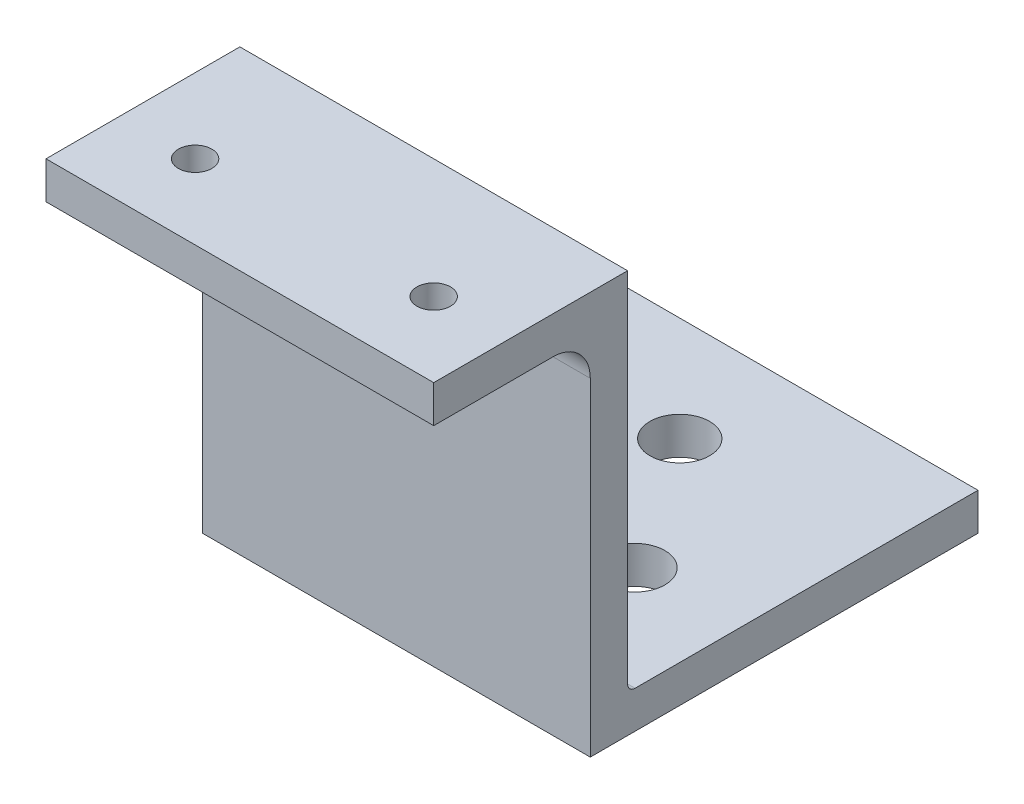
ISO-10303-21;
HEADER;
FILE_DESCRIPTION(('STEP AP214'),'2;1');
FILE_NAME('part.step','',(''),(''),'','','');
FILE_SCHEMA(('AUTOMOTIVE_DESIGN { 1 0 10303 214 1 1 1 1 }'));
ENDSEC;
DATA;
#1=APPLICATION_CONTEXT('core data for automotive mechanical design processes');
#2=APPLICATION_PROTOCOL_DEFINITION('international standard','automotive_design',2000,#1);
#3=PRODUCT_CONTEXT('',#1,'mechanical');
#4=PRODUCT('Part','Part','',(#3));
#5=PRODUCT_RELATED_PRODUCT_CATEGORY('part','',(#4));
#6=PRODUCT_DEFINITION_FORMATION('','',#4);
#7=PRODUCT_DEFINITION_CONTEXT('part definition',#1,'design');
#8=PRODUCT_DEFINITION('design','',#6,#7);
#9=PRODUCT_DEFINITION_SHAPE('','',#8);
#10=(LENGTH_UNIT() NAMED_UNIT(*) SI_UNIT(.MILLI.,.METRE.));
#11=(NAMED_UNIT(*) PLANE_ANGLE_UNIT() SI_UNIT($,.RADIAN.));
#12=(NAMED_UNIT(*) SI_UNIT($,.STERADIAN.) SOLID_ANGLE_UNIT());
#13=UNCERTAINTY_MEASURE_WITH_UNIT(LENGTH_MEASURE(1.E-05),#10,'distance_accuracy_value','');
#14=(GEOMETRIC_REPRESENTATION_CONTEXT(3) GLOBAL_UNCERTAINTY_ASSIGNED_CONTEXT((#13)) GLOBAL_UNIT_ASSIGNED_CONTEXT((#10,
#11,#12)) REPRESENTATION_CONTEXT('',''));
#15=CARTESIAN_POINT('',(0.,0.,0.));
#16=DIRECTION('',(0.,0.,1.));
#17=DIRECTION('',(1.,0.,0.));
#18=AXIS2_PLACEMENT_3D('',#15,#16,#17);
#19=CARTESIAN_POINT('',(-6.00000000000001,5.,-46.));
#20=DIRECTION('',(1.,0.,0.));
#21=DIRECTION('',(0.,0.,-1.));
#22=AXIS2_PLACEMENT_3D('',#19,#20,#21);
#23=PLANE('',#22);
#24=DIRECTION('',(0.,-1.,0.));
#25=VECTOR('',#24,1.);
#26=CARTESIAN_POINT('',(-6.00000000000001,5.,-46.));
#27=LINE('',#26,#25);
#28=CARTESIAN_POINT('',(-6.00000000000001,10.,-46.));
#29=VERTEX_POINT('',#28);
#30=CARTESIAN_POINT('',(-6.00000000000001,5.,-46.));
#31=VERTEX_POINT('',#30);
#32=EDGE_CURVE('E137',#29,#31,#27,.T.);
#33=ORIENTED_EDGE('',*,*,#32,.T.);
#34=DIRECTION('',(0.,0.,-1.));
#35=VECTOR('',#34,1.);
#36=CARTESIAN_POINT('',(-6.00000000000023,5.,6.));
#37=LINE('',#36,#35);
#38=CARTESIAN_POINT('',(-6.00000000000023,5.,6.));
#39=VERTEX_POINT('',#38);
#40=EDGE_CURVE('E52',#39,#31,#37,.T.);
#41=ORIENTED_EDGE('',*,*,#40,.F.);
#42=DIRECTION('',(0.,-1.,0.));
#43=VECTOR('',#42,1.);
#44=CARTESIAN_POINT('',(-6.00000000000023,5.,6.));
#45=LINE('',#44,#43);
#46=CARTESIAN_POINT('',(-6.00000000000023,49.,6.));
#47=VERTEX_POINT('',#46);
#48=EDGE_CURVE('E128',#47,#39,#45,.T.);
#49=ORIENTED_EDGE('',*,*,#48,.F.);
#50=CARTESIAN_POINT('',(-6.00000000000025,49.,11.));
#51=DIRECTION('',(1.,0.,0.));
#52=DIRECTION('',(0.,0.,-1.));
#53=AXIS2_PLACEMENT_3D('',#50,#51,#52);
#54=CIRCLE('',#53,5.);
#55=CARTESIAN_POINT('',(-6.00000000000023,54.,11.));
#56=VERTEX_POINT('',#55);
#57=EDGE_CURVE('E248',#47,#56,#54,.T.);
#58=ORIENTED_EDGE('',*,*,#57,.T.);
#59=DIRECTION('',(0.,0.,1.));
#60=VECTOR('',#59,1.);
#61=CARTESIAN_POINT('',(-6.00000000000023,54.,1.00000000000033));
#62=LINE('',#61,#60);
#63=CARTESIAN_POINT('',(-6.00000000000022,54.,27.0000000000003));
#64=VERTEX_POINT('',#63);
#65=EDGE_CURVE('E158',#56,#64,#62,.T.);
#66=ORIENTED_EDGE('',*,*,#65,.T.);
#67=DIRECTION('',(0.,-1.,0.));
#68=VECTOR('',#67,1.);
#69=CARTESIAN_POINT('',(-6.00000000000022,59.,27.0000000000003));
#70=LINE('',#69,#68);
#71=CARTESIAN_POINT('',(-6.00000000000022,59.,27.0000000000003));
#72=VERTEX_POINT('',#71);
#73=EDGE_CURVE('E171',#72,#64,#70,.T.);
#74=ORIENTED_EDGE('',*,*,#73,.F.);
#75=DIRECTION('',(0.,0.,1.));
#76=VECTOR('',#75,1.);
#77=CARTESIAN_POINT('',(-6.00000000000023,59.,1.00000000000033));
#78=LINE('',#77,#76);
#79=CARTESIAN_POINT('',(-6.00000000000023,59.,1.00000000000033));
#80=VERTEX_POINT('',#79);
#81=EDGE_CURVE('E219',#80,#72,#78,.T.);
#82=ORIENTED_EDGE('',*,*,#81,.F.);
#83=DIRECTION('',(0.,-1.,0.));
#84=VECTOR('',#83,1.);
#85=CARTESIAN_POINT('',(-6.00000000000023,54.,1.00000000000033));
#86=LINE('',#85,#84);
#87=CARTESIAN_POINT('',(-6.00000000000023,11.,1.00000000000033));
#88=VERTEX_POINT('',#87);
#89=EDGE_CURVE('E175',#80,#88,#86,.T.);
#90=ORIENTED_EDGE('',*,*,#89,.T.);
#91=CARTESIAN_POINT('',(-6.0000000000002,11.,3.33934269125535E-13));
#92=DIRECTION('',(1.,0.,0.));
#93=DIRECTION('',(0.,0.,-1.));
#94=AXIS2_PLACEMENT_3D('',#91,#92,#93);
#95=CIRCLE('',#94,1.);
#96=CARTESIAN_POINT('',(-6.0000000000002,10.,3.19189119579733E-13));
#97=VERTEX_POINT('',#96);
#98=EDGE_CURVE('E44',#88,#97,#95,.T.);
#99=ORIENTED_EDGE('',*,*,#98,.T.);
#100=DIRECTION('',(0.,0.,1.));
#101=VECTOR('',#100,1.);
#102=CARTESIAN_POINT('',(-6.00000000000001,10.,-46.));
#103=LINE('',#102,#101);
#104=EDGE_CURVE('E255',#29,#97,#103,.T.);
#105=ORIENTED_EDGE('',*,*,#104,.F.);
#106=EDGE_LOOP('',(#33,#41,#49,#58,#66,#74,#82,#90,#99,#105));
#107=FACE_BOUND('',#106,.T.);
#108=ADVANCED_FACE('F35',(#107),#23,.F.);
#109=CARTESIAN_POINT('',(-6.00000000000023,5.,6.));
#110=DIRECTION('',(0.,0.,-1.));
#111=DIRECTION('',(-1.,0.,0.));
#112=AXIS2_PLACEMENT_3D('',#109,#110,#111);
#113=PLANE('',#112);
#114=ORIENTED_EDGE('',*,*,#48,.T.);
#115=DIRECTION('',(-1.,0.,0.));
#116=VECTOR('',#115,1.);
#117=CARTESIAN_POINT('',(46.,5.,6.));
#118=LINE('',#117,#116);
#119=CARTESIAN_POINT('',(46.,5.,6.));
#120=VERTEX_POINT('',#119);
#121=EDGE_CURVE('E114',#120,#39,#118,.T.);
#122=ORIENTED_EDGE('',*,*,#121,.F.);
#123=DIRECTION('',(0.,-1.,0.));
#124=VECTOR('',#123,1.);
#125=CARTESIAN_POINT('',(46.,5.,6.));
#126=LINE('',#125,#124);
#127=CARTESIAN_POINT('',(46.,49.,6.));
#128=VERTEX_POINT('',#127);
#129=EDGE_CURVE('E125',#128,#120,#126,.T.);
#130=ORIENTED_EDGE('',*,*,#129,.F.);
#131=DIRECTION('',(1.,0.,0.));
#132=VECTOR('',#131,1.);
#133=CARTESIAN_POINT('',(-6.00000000000023,49.,6.));
#134=LINE('',#133,#132);
#135=EDGE_CURVE('E247',#128,#47,#134,.F.);
#136=ORIENTED_EDGE('',*,*,#135,.T.);
#137=EDGE_LOOP('',(#114,#122,#130,#136));
#138=FACE_BOUND('',#137,.T.);
#139=ADVANCED_FACE('F124',(#138),#113,.F.);
#140=CARTESIAN_POINT('',(46.,5.,-46.));
#141=DIRECTION('',(-1.,0.,0.));
#142=DIRECTION('',(0.,0.,1.));
#143=AXIS2_PLACEMENT_3D('',#140,#141,#142);
#144=PLANE('',#143);
#145=ORIENTED_EDGE('',*,*,#129,.T.);
#146=DIRECTION('',(0.,0.,1.));
#147=VECTOR('',#146,1.);
#148=CARTESIAN_POINT('',(46.,5.,-46.));
#149=LINE('',#148,#147);
#150=CARTESIAN_POINT('',(46.,5.,-46.));
#151=VERTEX_POINT('',#150);
#152=EDGE_CURVE('E111',#151,#120,#149,.T.);
#153=ORIENTED_EDGE('',*,*,#152,.F.);
#154=DIRECTION('',(0.,-1.,0.));
#155=VECTOR('',#154,1.);
#156=CARTESIAN_POINT('',(46.,5.,-46.));
#157=LINE('',#156,#155);
#158=CARTESIAN_POINT('',(46.,10.,-46.));
#159=VERTEX_POINT('',#158);
#160=EDGE_CURVE('E133',#159,#151,#157,.T.);
#161=ORIENTED_EDGE('',*,*,#160,.F.);
#162=DIRECTION('',(0.,0.,-1.));
#163=VECTOR('',#162,1.);
#164=CARTESIAN_POINT('',(46.,10.,6.));
#165=LINE('',#164,#163);
#166=CARTESIAN_POINT('',(46.,10.,0.));
#167=VERTEX_POINT('',#166);
#168=EDGE_CURVE('E182',#167,#159,#165,.T.);
#169=ORIENTED_EDGE('',*,*,#168,.F.);
#170=CARTESIAN_POINT('',(46.,11.,0.));
#171=DIRECTION('',(-1.,0.,0.));
#172=DIRECTION('',(0.,0.,1.));
#173=AXIS2_PLACEMENT_3D('',#170,#171,#172);
#174=CIRCLE('',#173,1.);
#175=CARTESIAN_POINT('',(46.,11.,1.));
#176=VERTEX_POINT('',#175);
#177=EDGE_CURVE('E11',#167,#176,#174,.T.);
#178=ORIENTED_EDGE('',*,*,#177,.T.);
#179=DIRECTION('',(0.,-1.,0.));
#180=VECTOR('',#179,1.);
#181=CARTESIAN_POINT('',(46.,54.,1.));
#182=LINE('',#181,#180);
#183=CARTESIAN_POINT('',(46.,59.,1.));
#184=VERTEX_POINT('',#183);
#185=EDGE_CURVE('E185',#184,#176,#182,.T.);
#186=ORIENTED_EDGE('',*,*,#185,.F.);
#187=DIRECTION('',(0.,0.,-1.));
#188=VECTOR('',#187,1.);
#189=CARTESIAN_POINT('',(46.,59.,1.));
#190=LINE('',#189,#188);
#191=CARTESIAN_POINT('',(46.,59.,27.));
#192=VERTEX_POINT('',#191);
#193=EDGE_CURVE('E167',#192,#184,#190,.T.);
#194=ORIENTED_EDGE('',*,*,#193,.F.);
#195=DIRECTION('',(0.,-1.,0.));
#196=VECTOR('',#195,1.);
#197=CARTESIAN_POINT('',(46.,59.,27.));
#198=LINE('',#197,#196);
#199=CARTESIAN_POINT('',(46.,54.,27.));
#200=VERTEX_POINT('',#199);
#201=EDGE_CURVE('E168',#192,#200,#198,.T.);
#202=ORIENTED_EDGE('',*,*,#201,.T.);
#203=DIRECTION('',(0.,0.,-1.));
#204=VECTOR('',#203,1.);
#205=CARTESIAN_POINT('',(46.,54.,1.));
#206=LINE('',#205,#204);
#207=CARTESIAN_POINT('',(46.,54.,11.));
#208=VERTEX_POINT('',#207);
#209=EDGE_CURVE('E153',#200,#208,#206,.T.);
#210=ORIENTED_EDGE('',*,*,#209,.T.);
#211=CARTESIAN_POINT('',(46.,49.,11.));
#212=DIRECTION('',(-1.,0.,0.));
#213=DIRECTION('',(0.,0.,1.));
#214=AXIS2_PLACEMENT_3D('',#211,#212,#213);
#215=CIRCLE('',#214,5.);
#216=EDGE_CURVE('E132',#208,#128,#215,.T.);
#217=ORIENTED_EDGE('',*,*,#216,.T.);
#218=EDGE_LOOP('',(#145,#153,#161,#169,#178,#186,#194,#202,#210,#217));
#219=FACE_BOUND('',#218,.T.);
#220=ADVANCED_FACE('F130',(#219),#144,.F.);
#221=CARTESIAN_POINT('',(-6.00000000000001,5.,-46.));
#222=DIRECTION('',(0.,0.,1.));
#223=DIRECTION('',(1.,0.,0.));
#224=AXIS2_PLACEMENT_3D('',#221,#222,#223);
#225=PLANE('',#224);
#226=ORIENTED_EDGE('',*,*,#160,.T.);
#227=DIRECTION('',(1.,0.,0.));
#228=VECTOR('',#227,1.);
#229=CARTESIAN_POINT('',(-6.00000000000001,5.,-46.));
#230=LINE('',#229,#228);
#231=EDGE_CURVE('E115',#31,#151,#230,.T.);
#232=ORIENTED_EDGE('',*,*,#231,.F.);
#233=ORIENTED_EDGE('',*,*,#32,.F.);
#234=DIRECTION('',(-1.,0.,0.));
#235=VECTOR('',#234,1.);
#236=CARTESIAN_POINT('',(46.,10.,-46.));
#237=LINE('',#236,#235);
#238=EDGE_CURVE('E179',#159,#29,#237,.T.);
#239=ORIENTED_EDGE('',*,*,#238,.F.);
#240=EDGE_LOOP('',(#226,#232,#233,#239));
#241=FACE_BOUND('',#240,.T.);
#242=ADVANCED_FACE('F258',(#241),#225,.F.);
#243=CARTESIAN_POINT('',(0.,5.,0.));
#244=DIRECTION('',(0.,1.,0.));
#245=DIRECTION('',(0.,0.,1.));
#246=AXIS2_PLACEMENT_3D('',#243,#244,#245);
#247=PLANE('',#246);
#248=CARTESIAN_POINT('',(7.99999999999999,5.,-14.));
#249=DIRECTION('',(0.,-1.,0.));
#250=DIRECTION('',(0.,0.,-1.));
#251=AXIS2_PLACEMENT_3D('',#248,#249,#250);
#252=CIRCLE('',#251,4.);
#253=CARTESIAN_POINT('',(7.99999999999999,5.,-18.));
#254=VERTEX_POINT('',#253);
#255=EDGE_CURVE('E206',#254,#254,#252,.T.);
#256=ORIENTED_EDGE('',*,*,#255,.F.);
#257=EDGE_LOOP('',(#256));
#258=FACE_BOUND('',#257,.T.);
#259=CARTESIAN_POINT('',(32.,5.,-14.));
#260=DIRECTION('',(0.,-1.,0.));
#261=DIRECTION('',(0.,0.,-1.));
#262=AXIS2_PLACEMENT_3D('',#259,#260,#261);
#263=CIRCLE('',#262,4.00000000000001);
#264=CARTESIAN_POINT('',(32.,5.,-18.));
#265=VERTEX_POINT('',#264);
#266=EDGE_CURVE('E196',#265,#265,#263,.T.);
#267=ORIENTED_EDGE('',*,*,#266,.F.);
#268=EDGE_LOOP('',(#267));
#269=FACE_BOUND('',#268,.T.);
#270=CARTESIAN_POINT('',(20.,5.,-32.));
#271=DIRECTION('',(0.,-1.,0.));
#272=DIRECTION('',(0.,0.,-1.));
#273=AXIS2_PLACEMENT_3D('',#270,#271,#272);
#274=CIRCLE('',#273,4.);
#275=CARTESIAN_POINT('',(20.,5.,-36.));
#276=VERTEX_POINT('',#275);
#277=EDGE_CURVE('E193',#276,#276,#274,.T.);
#278=ORIENTED_EDGE('',*,*,#277,.F.);
#279=EDGE_LOOP('',(#278));
#280=FACE_BOUND('',#279,.T.);
#281=ORIENTED_EDGE('',*,*,#121,.T.);
#282=ORIENTED_EDGE('',*,*,#40,.T.);
#283=ORIENTED_EDGE('',*,*,#231,.T.);
#284=ORIENTED_EDGE('',*,*,#152,.T.);
#285=EDGE_LOOP('',(#281,#282,#283,#284));
#286=FACE_BOUND('',#285,.T.);
#287=ADVANCED_FACE('F113',(#258,#269,#280,#286),#247,.F.);
#288=CARTESIAN_POINT('',(0.,10.,0.));
#289=DIRECTION('',(0.,1.,0.));
#290=DIRECTION('',(0.,0.,1.));
#291=AXIS2_PLACEMENT_3D('',#288,#289,#290);
#292=PLANE('',#291);
#293=CARTESIAN_POINT('',(7.99999999999999,10.,-14.));
#294=DIRECTION('',(0.,1.,0.));
#295=DIRECTION('',(0.,0.,1.));
#296=AXIS2_PLACEMENT_3D('',#293,#294,#295);
#297=CIRCLE('',#296,4.);
#298=CARTESIAN_POINT('',(7.99999999999999,10.,-10.));
#299=VERTEX_POINT('',#298);
#300=EDGE_CURVE('E39',#299,#299,#297,.T.);
#301=ORIENTED_EDGE('',*,*,#300,.F.);
#302=EDGE_LOOP('',(#301));
#303=FACE_BOUND('',#302,.T.);
#304=CARTESIAN_POINT('',(32.,10.,-14.));
#305=DIRECTION('',(0.,1.,0.));
#306=DIRECTION('',(0.,0.,1.));
#307=AXIS2_PLACEMENT_3D('',#304,#305,#306);
#308=CIRCLE('',#307,4.00000000000001);
#309=CARTESIAN_POINT('',(32.,10.,-9.99999999999999));
#310=VERTEX_POINT('',#309);
#311=EDGE_CURVE('E194',#310,#310,#308,.T.);
#312=ORIENTED_EDGE('',*,*,#311,.F.);
#313=EDGE_LOOP('',(#312));
#314=FACE_BOUND('',#313,.T.);
#315=CARTESIAN_POINT('',(20.,10.,-32.));
#316=DIRECTION('',(0.,1.,0.));
#317=DIRECTION('',(0.,0.,1.));
#318=AXIS2_PLACEMENT_3D('',#315,#316,#317);
#319=CIRCLE('',#318,4.);
#320=CARTESIAN_POINT('',(20.,10.,-28.));
#321=VERTEX_POINT('',#320);
#322=EDGE_CURVE('E191',#321,#321,#319,.T.);
#323=ORIENTED_EDGE('',*,*,#322,.F.);
#324=EDGE_LOOP('',(#323));
#325=FACE_BOUND('',#324,.T.);
#326=ORIENTED_EDGE('',*,*,#104,.T.);
#327=DIRECTION('',(-1.,0.,0.));
#328=VECTOR('',#327,1.);
#329=CARTESIAN_POINT('',(0.,10.,2.95403391918741E-13));
#330=LINE('',#329,#328);
#331=EDGE_CURVE('E188',#97,#167,#330,.F.);
#332=ORIENTED_EDGE('',*,*,#331,.T.);
#333=ORIENTED_EDGE('',*,*,#168,.T.);
#334=ORIENTED_EDGE('',*,*,#238,.T.);
#335=EDGE_LOOP('',(#326,#332,#333,#334));
#336=FACE_BOUND('',#335,.T.);
#337=ADVANCED_FACE('F253',(#303,#314,#325,#336),#292,.T.);
#338=CARTESIAN_POINT('',(46.,54.,1.));
#339=DIRECTION('',(0.,0.,1.));
#340=DIRECTION('',(1.,0.,0.));
#341=AXIS2_PLACEMENT_3D('',#338,#339,#340);
#342=PLANE('',#341);
#343=ORIENTED_EDGE('',*,*,#185,.T.);
#344=DIRECTION('',(-1.,0.,0.));
#345=VECTOR('',#344,1.);
#346=CARTESIAN_POINT('',(46.,11.,1.));
#347=LINE('',#346,#345);
#348=EDGE_CURVE('E186',#176,#88,#347,.T.);
#349=ORIENTED_EDGE('',*,*,#348,.T.);
#350=ORIENTED_EDGE('',*,*,#89,.F.);
#351=DIRECTION('',(-1.,0.,0.));
#352=VECTOR('',#351,1.);
#353=CARTESIAN_POINT('',(46.,59.,1.));
#354=LINE('',#353,#352);
#355=EDGE_CURVE('E216',#184,#80,#354,.T.);
#356=ORIENTED_EDGE('',*,*,#355,.F.);
#357=EDGE_LOOP('',(#343,#349,#350,#356));
#358=FACE_BOUND('',#357,.T.);
#359=ADVANCED_FACE('F238',(#358),#342,.F.);
#360=CARTESIAN_POINT('',(46.,59.,27.));
#361=DIRECTION('',(0.,0.,-1.));
#362=DIRECTION('',(-1.,0.,0.));
#363=AXIS2_PLACEMENT_3D('',#360,#361,#362);
#364=PLANE('',#363);
#365=DIRECTION('',(1.,0.,0.));
#366=VECTOR('',#365,1.);
#367=CARTESIAN_POINT('',(46.,54.,27.));
#368=LINE('',#367,#366);
#369=EDGE_CURVE('E160',#64,#200,#368,.T.);
#370=ORIENTED_EDGE('',*,*,#369,.T.);
#371=ORIENTED_EDGE('',*,*,#201,.F.);
#372=DIRECTION('',(1.,0.,0.));
#373=VECTOR('',#372,1.);
#374=CARTESIAN_POINT('',(46.,59.,27.));
#375=LINE('',#374,#373);
#376=EDGE_CURVE('E172',#72,#192,#375,.T.);
#377=ORIENTED_EDGE('',*,*,#376,.F.);
#378=ORIENTED_EDGE('',*,*,#73,.T.);
#379=EDGE_LOOP('',(#370,#371,#377,#378));
#380=FACE_BOUND('',#379,.T.);
#381=ADVANCED_FACE('F228',(#380),#364,.F.);
#382=CARTESIAN_POINT('',(0.,59.,0.));
#383=DIRECTION('',(0.,-1.,0.));
#384=DIRECTION('',(0.,0.,-1.));
#385=AXIS2_PLACEMENT_3D('',#382,#383,#384);
#386=PLANE('',#385);
#387=CARTESIAN_POINT('',(3.99999999999956,59.,17.0000000000003));
#388=DIRECTION('',(0.,1.,0.));
#389=DIRECTION('',(0.,0.,1.));
#390=AXIS2_PLACEMENT_3D('',#387,#388,#389);
#391=CIRCLE('',#390,2.24999999999927);
#392=CARTESIAN_POINT('',(3.99999999999956,59.,19.2499999999996));
#393=VERTEX_POINT('',#392);
#394=EDGE_CURVE('E157',#393,#393,#391,.T.);
#395=ORIENTED_EDGE('',*,*,#394,.F.);
#396=EDGE_LOOP('',(#395));
#397=FACE_BOUND('',#396,.T.);
#398=CARTESIAN_POINT('',(36.,59.,17.0000000000003));
#399=DIRECTION('',(0.,1.,0.));
#400=DIRECTION('',(0.,0.,1.));
#401=AXIS2_PLACEMENT_3D('',#398,#399,#400);
#402=CIRCLE('',#401,2.25);
#403=CARTESIAN_POINT('',(36.,59.,19.2500000000003));
#404=VERTEX_POINT('',#403);
#405=EDGE_CURVE('E154',#404,#404,#402,.T.);
#406=ORIENTED_EDGE('',*,*,#405,.F.);
#407=EDGE_LOOP('',(#406));
#408=FACE_BOUND('',#407,.T.);
#409=ORIENTED_EDGE('',*,*,#193,.T.);
#410=ORIENTED_EDGE('',*,*,#355,.T.);
#411=ORIENTED_EDGE('',*,*,#81,.T.);
#412=ORIENTED_EDGE('',*,*,#376,.T.);
#413=EDGE_LOOP('',(#409,#410,#411,#412));
#414=FACE_BOUND('',#413,.T.);
#415=ADVANCED_FACE('F223',(#397,#408,#414),#386,.F.);
#416=CARTESIAN_POINT('',(0.,54.,0.));
#417=DIRECTION('',(0.,-1.,0.));
#418=DIRECTION('',(0.,0.,-1.));
#419=AXIS2_PLACEMENT_3D('',#416,#417,#418);
#420=PLANE('',#419);
#421=CARTESIAN_POINT('',(3.99999999999956,54.,17.0000000000003));
#422=DIRECTION('',(0.,-1.,0.));
#423=DIRECTION('',(0.,0.,-1.));
#424=AXIS2_PLACEMENT_3D('',#421,#422,#423);
#425=CIRCLE('',#424,2.24999999999927);
#426=CARTESIAN_POINT('',(3.99999999999956,54.,14.7500000000011));
#427=VERTEX_POINT('',#426);
#428=EDGE_CURVE('E155',#427,#427,#425,.T.);
#429=ORIENTED_EDGE('',*,*,#428,.F.);
#430=EDGE_LOOP('',(#429));
#431=FACE_BOUND('',#430,.T.);
#432=CARTESIAN_POINT('',(36.,54.,17.0000000000003));
#433=DIRECTION('',(0.,-1.,0.));
#434=DIRECTION('',(0.,0.,-1.));
#435=AXIS2_PLACEMENT_3D('',#432,#433,#434);
#436=CIRCLE('',#435,2.25);
#437=CARTESIAN_POINT('',(36.,54.,14.7500000000003));
#438=VERTEX_POINT('',#437);
#439=EDGE_CURVE('E150',#438,#438,#436,.T.);
#440=ORIENTED_EDGE('',*,*,#439,.F.);
#441=EDGE_LOOP('',(#440));
#442=FACE_BOUND('',#441,.T.);
#443=ORIENTED_EDGE('',*,*,#65,.F.);
#444=DIRECTION('',(1.,0.,0.));
#445=VECTOR('',#444,1.);
#446=CARTESIAN_POINT('',(0.,54.,11.));
#447=LINE('',#446,#445);
#448=EDGE_CURVE('E135',#56,#208,#447,.T.);
#449=ORIENTED_EDGE('',*,*,#448,.T.);
#450=ORIENTED_EDGE('',*,*,#209,.F.);
#451=ORIENTED_EDGE('',*,*,#369,.F.);
#452=EDGE_LOOP('',(#443,#449,#450,#451));
#453=FACE_BOUND('',#452,.T.);
#454=ADVANCED_FACE('F242',(#431,#442,#453),#420,.T.);
#455=CARTESIAN_POINT('',(36.,-2.50000000007189E-05,17.0000000000003));
#456=DIRECTION('',(0.,1.,0.));
#457=DIRECTION('',(0.,0.,1.));
#458=AXIS2_PLACEMENT_3D('',#455,#456,#457);
#459=CYLINDRICAL_SURFACE('',#458,2.25);
#460=ORIENTED_EDGE('',*,*,#439,.T.);
#461=EDGE_LOOP('',(#460));
#462=FACE_BOUND('',#461,.T.);
#463=ORIENTED_EDGE('',*,*,#405,.T.);
#464=EDGE_LOOP('',(#463));
#465=FACE_BOUND('',#464,.T.);
#466=ADVANCED_FACE('F301',(#462,#465),#459,.F.);
#467=CARTESIAN_POINT('',(3.99999999999956,-2.50000000007189E-05,17.0000000000003));
#468=DIRECTION('',(0.,1.,0.));
#469=DIRECTION('',(0.,0.,1.));
#470=AXIS2_PLACEMENT_3D('',#467,#468,#469);
#471=CYLINDRICAL_SURFACE('',#470,2.24999999999927);
#472=ORIENTED_EDGE('',*,*,#428,.T.);
#473=EDGE_LOOP('',(#472));
#474=FACE_BOUND('',#473,.T.);
#475=ORIENTED_EDGE('',*,*,#394,.T.);
#476=EDGE_LOOP('',(#475));
#477=FACE_BOUND('',#476,.T.);
#478=ADVANCED_FACE('F297',(#474,#477),#471,.F.);
#479=CARTESIAN_POINT('',(0.,49.,11.));
#480=DIRECTION('',(1.,0.,0.));
#481=DIRECTION('',(0.,0.,-1.));
#482=AXIS2_PLACEMENT_3D('',#479,#480,#481);
#483=CYLINDRICAL_SURFACE('',#482,5.);
#484=ORIENTED_EDGE('',*,*,#57,.F.);
#485=ORIENTED_EDGE('',*,*,#135,.F.);
#486=ORIENTED_EDGE('',*,*,#216,.F.);
#487=ORIENTED_EDGE('',*,*,#448,.F.);
#488=EDGE_LOOP('',(#484,#485,#486,#487));
#489=FACE_BOUND('',#488,.T.);
#490=ADVANCED_FACE('F287',(#489),#483,.F.);
#491=CARTESIAN_POINT('',(46.,11.,0.));
#492=DIRECTION('',(-1.,0.,0.));
#493=DIRECTION('',(0.,0.,1.));
#494=AXIS2_PLACEMENT_3D('',#491,#492,#493);
#495=CYLINDRICAL_SURFACE('',#494,1.);
#496=ORIENTED_EDGE('',*,*,#177,.F.);
#497=ORIENTED_EDGE('',*,*,#331,.F.);
#498=ORIENTED_EDGE('',*,*,#98,.F.);
#499=ORIENTED_EDGE('',*,*,#348,.F.);
#500=EDGE_LOOP('',(#496,#497,#498,#499));
#501=FACE_BOUND('',#500,.T.);
#502=ADVANCED_FACE('F37',(#501),#495,.F.);
#503=CARTESIAN_POINT('',(20.,59.,-32.));
#504=DIRECTION('',(0.,-1.,0.));
#505=DIRECTION('',(0.,0.,-1.));
#506=AXIS2_PLACEMENT_3D('',#503,#504,#505);
#507=CYLINDRICAL_SURFACE('',#506,4.);
#508=ORIENTED_EDGE('',*,*,#322,.T.);
#509=EDGE_LOOP('',(#508));
#510=FACE_BOUND('',#509,.T.);
#511=ORIENTED_EDGE('',*,*,#277,.T.);
#512=EDGE_LOOP('',(#511));
#513=FACE_BOUND('',#512,.T.);
#514=ADVANCED_FACE('F277',(#510,#513),#507,.F.);
#515=CARTESIAN_POINT('',(32.,59.,-14.));
#516=DIRECTION('',(0.,-1.,0.));
#517=DIRECTION('',(0.,0.,-1.));
#518=AXIS2_PLACEMENT_3D('',#515,#516,#517);
#519=CYLINDRICAL_SURFACE('',#518,4.00000000000001);
#520=ORIENTED_EDGE('',*,*,#311,.T.);
#521=EDGE_LOOP('',(#520));
#522=FACE_BOUND('',#521,.T.);
#523=ORIENTED_EDGE('',*,*,#266,.T.);
#524=EDGE_LOOP('',(#523));
#525=FACE_BOUND('',#524,.T.);
#526=ADVANCED_FACE('F279',(#522,#525),#519,.F.);
#527=CARTESIAN_POINT('',(7.99999999999999,59.,-14.));
#528=DIRECTION('',(0.,-1.,0.));
#529=DIRECTION('',(0.,0.,-1.));
#530=AXIS2_PLACEMENT_3D('',#527,#528,#529);
#531=CYLINDRICAL_SURFACE('',#530,4.);
#532=ORIENTED_EDGE('',*,*,#300,.T.);
#533=EDGE_LOOP('',(#532));
#534=FACE_BOUND('',#533,.T.);
#535=ORIENTED_EDGE('',*,*,#255,.T.);
#536=EDGE_LOOP('',(#535));
#537=FACE_BOUND('',#536,.T.);
#538=ADVANCED_FACE('F269',(#534,#537),#531,.F.);
#539=CLOSED_SHELL('',(#108,#139,#220,#242,#287,#337,#359,#381,#415,#454,#466,#478,#490,#502,
#514,#526,#538));
#540=MANIFOLD_SOLID_BREP('B2',#539);
#541=ADVANCED_BREP_SHAPE_REPRESENTATION('',(#18,#540),#14);
#542=SHAPE_DEFINITION_REPRESENTATION(#9,#541);
ENDSEC;
END-ISO-10303-21;
